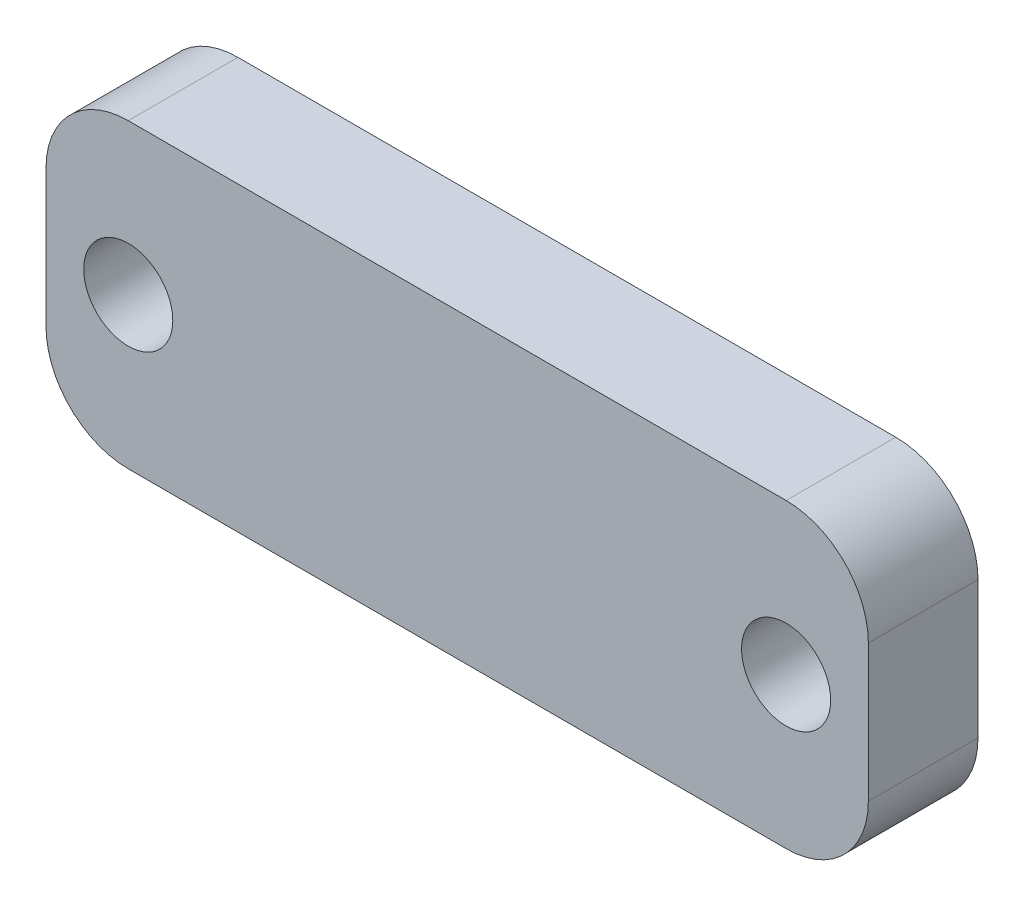
ISO-10303-21;
HEADER;
FILE_DESCRIPTION(('STEP AP214'),'2;1');
FILE_NAME('part.step','',(''),(''),'','','');
FILE_SCHEMA(('AUTOMOTIVE_DESIGN { 1 0 10303 214 1 1 1 1 }'));
ENDSEC;
DATA;
#1=APPLICATION_CONTEXT('core data for automotive mechanical design processes');
#2=APPLICATION_PROTOCOL_DEFINITION('international standard','automotive_design',2000,#1);
#3=PRODUCT_CONTEXT('',#1,'mechanical');
#4=PRODUCT('Part','Part','',(#3));
#5=PRODUCT_RELATED_PRODUCT_CATEGORY('part','',(#4));
#6=PRODUCT_DEFINITION_FORMATION('','',#4);
#7=PRODUCT_DEFINITION_CONTEXT('part definition',#1,'design');
#8=PRODUCT_DEFINITION('design','',#6,#7);
#9=PRODUCT_DEFINITION_SHAPE('','',#8);
#10=(LENGTH_UNIT() NAMED_UNIT(*) SI_UNIT(.MILLI.,.METRE.));
#11=(NAMED_UNIT(*) PLANE_ANGLE_UNIT() SI_UNIT($,.RADIAN.));
#12=(NAMED_UNIT(*) SI_UNIT($,.STERADIAN.) SOLID_ANGLE_UNIT());
#13=UNCERTAINTY_MEASURE_WITH_UNIT(LENGTH_MEASURE(1.E-05),#10,'distance_accuracy_value','');
#14=(GEOMETRIC_REPRESENTATION_CONTEXT(3) GLOBAL_UNCERTAINTY_ASSIGNED_CONTEXT((#13)) GLOBAL_UNIT_ASSIGNED_CONTEXT((#10,
#11,#12)) REPRESENTATION_CONTEXT('',''));
#15=CARTESIAN_POINT('',(0.,0.,0.));
#16=DIRECTION('',(0.,0.,1.));
#17=DIRECTION('',(1.,0.,0.));
#18=AXIS2_PLACEMENT_3D('',#15,#16,#17);
#19=CARTESIAN_POINT('',(-47.625,17.4625,12.7));
#20=DIRECTION('',(1.,0.,0.));
#21=DIRECTION('',(0.,1.,0.));
#22=AXIS2_PLACEMENT_3D('',#19,#20,#21);
#23=PLANE('',#22);
#24=DIRECTION('',(0.,-1.,0.));
#25=VECTOR('',#24,1.);
#26=CARTESIAN_POINT('',(-47.625,17.4625,0.));
#27=LINE('',#26,#25);
#28=CARTESIAN_POINT('',(-47.625,7.93749999999999,0.));
#29=VERTEX_POINT('',#28);
#30=CARTESIAN_POINT('',(-47.625,-7.93750000000001,0.));
#31=VERTEX_POINT('',#30);
#32=EDGE_CURVE('E131',#29,#31,#27,.T.);
#33=ORIENTED_EDGE('',*,*,#32,.T.);
#34=DIRECTION('',(0.,0.,-1.));
#35=VECTOR('',#34,1.);
#36=CARTESIAN_POINT('',(-47.625,-7.93750000000001,12.7));
#37=LINE('',#36,#35);
#38=CARTESIAN_POINT('',(-47.625,-7.93750000000001,12.7));
#39=VERTEX_POINT('',#38);
#40=EDGE_CURVE('E108',#31,#39,#37,.F.);
#41=ORIENTED_EDGE('',*,*,#40,.T.);
#42=DIRECTION('',(0.,-1.,0.));
#43=VECTOR('',#42,1.);
#44=CARTESIAN_POINT('',(-47.625,17.4625,12.7));
#45=LINE('',#44,#43);
#46=CARTESIAN_POINT('',(-47.625,7.93749999999999,12.7));
#47=VERTEX_POINT('',#46);
#48=EDGE_CURVE('E141',#47,#39,#45,.T.);
#49=ORIENTED_EDGE('',*,*,#48,.F.);
#50=DIRECTION('',(0.,0.,-1.));
#51=VECTOR('',#50,1.);
#52=CARTESIAN_POINT('',(-47.625,7.93749999999999,12.7));
#53=LINE('',#52,#51);
#54=EDGE_CURVE('E113',#47,#29,#53,.T.);
#55=ORIENTED_EDGE('',*,*,#54,.T.);
#56=EDGE_LOOP('',(#33,#41,#49,#55));
#57=FACE_BOUND('',#56,.T.);
#58=ADVANCED_FACE('F36',(#57),#23,.F.);
#59=CARTESIAN_POINT('',(47.625,-17.4625,12.7));
#60=DIRECTION('',(0.,1.,0.));
#61=DIRECTION('',(-1.,0.,0.));
#62=AXIS2_PLACEMENT_3D('',#59,#60,#61);
#63=PLANE('',#62);
#64=DIRECTION('',(1.,0.,0.));
#65=VECTOR('',#64,1.);
#66=CARTESIAN_POINT('',(47.625,-17.4625,12.7));
#67=LINE('',#66,#65);
#68=CARTESIAN_POINT('',(-38.1,-17.4625,12.7));
#69=VERTEX_POINT('',#68);
#70=CARTESIAN_POINT('',(38.1,-17.4625,12.7));
#71=VERTEX_POINT('',#70);
#72=EDGE_CURVE('E123',#69,#71,#67,.T.);
#73=ORIENTED_EDGE('',*,*,#72,.F.);
#74=DIRECTION('',(0.,0.,-1.));
#75=VECTOR('',#74,1.);
#76=CARTESIAN_POINT('',(-38.1,-17.4625,12.7));
#77=LINE('',#76,#75);
#78=CARTESIAN_POINT('',(-38.1,-17.4625,0.));
#79=VERTEX_POINT('',#78);
#80=EDGE_CURVE('E107',#69,#79,#77,.T.);
#81=ORIENTED_EDGE('',*,*,#80,.T.);
#82=DIRECTION('',(1.,0.,0.));
#83=VECTOR('',#82,1.);
#84=CARTESIAN_POINT('',(47.625,-17.4625,0.));
#85=LINE('',#84,#83);
#86=CARTESIAN_POINT('',(38.1,-17.4625,0.));
#87=VERTEX_POINT('',#86);
#88=EDGE_CURVE('E120',#79,#87,#85,.T.);
#89=ORIENTED_EDGE('',*,*,#88,.T.);
#90=DIRECTION('',(0.,0.,-1.));
#91=VECTOR('',#90,1.);
#92=CARTESIAN_POINT('',(38.1,-17.4625,12.7));
#93=LINE('',#92,#91);
#94=EDGE_CURVE('E125',#87,#71,#93,.F.);
#95=ORIENTED_EDGE('',*,*,#94,.T.);
#96=EDGE_LOOP('',(#73,#81,#89,#95));
#97=FACE_BOUND('',#96,.T.);
#98=ADVANCED_FACE('F119',(#97),#63,.F.);
#99=CARTESIAN_POINT('',(47.625,17.4625,12.7));
#100=DIRECTION('',(-1.,0.,0.));
#101=DIRECTION('',(0.,0.,1.));
#102=AXIS2_PLACEMENT_3D('',#99,#100,#101);
#103=PLANE('',#102);
#104=DIRECTION('',(0.,1.,0.));
#105=VECTOR('',#104,1.);
#106=CARTESIAN_POINT('',(47.625,17.4625,12.7));
#107=LINE('',#106,#105);
#108=CARTESIAN_POINT('',(47.625,-7.9375,12.7));
#109=VERTEX_POINT('',#108);
#110=CARTESIAN_POINT('',(47.625,7.9375,12.7));
#111=VERTEX_POINT('',#110);
#112=EDGE_CURVE('E170',#109,#111,#107,.T.);
#113=ORIENTED_EDGE('',*,*,#112,.F.);
#114=DIRECTION('',(0.,0.,-1.));
#115=VECTOR('',#114,1.);
#116=CARTESIAN_POINT('',(47.625,-7.9375,12.7));
#117=LINE('',#116,#115);
#118=CARTESIAN_POINT('',(47.625,-7.9375,0.));
#119=VERTEX_POINT('',#118);
#120=EDGE_CURVE('E11',#109,#119,#117,.T.);
#121=ORIENTED_EDGE('',*,*,#120,.T.);
#122=DIRECTION('',(0.,1.,0.));
#123=VECTOR('',#122,1.);
#124=CARTESIAN_POINT('',(47.625,17.4625,0.));
#125=LINE('',#124,#123);
#126=CARTESIAN_POINT('',(47.625,7.9375,0.));
#127=VERTEX_POINT('',#126);
#128=EDGE_CURVE('E130',#119,#127,#125,.T.);
#129=ORIENTED_EDGE('',*,*,#128,.T.);
#130=DIRECTION('',(0.,0.,-1.));
#131=VECTOR('',#130,1.);
#132=CARTESIAN_POINT('',(47.625,7.9375,12.7));
#133=LINE('',#132,#131);
#134=EDGE_CURVE('E44',#127,#111,#133,.F.);
#135=ORIENTED_EDGE('',*,*,#134,.T.);
#136=EDGE_LOOP('',(#113,#121,#129,#135));
#137=FACE_BOUND('',#136,.T.);
#138=ADVANCED_FACE('F169',(#137),#103,.F.);
#139=CARTESIAN_POINT('',(47.625,17.4625,12.7));
#140=DIRECTION('',(0.,-1.,0.));
#141=DIRECTION('',(1.,0.,0.));
#142=AXIS2_PLACEMENT_3D('',#139,#140,#141);
#143=PLANE('',#142);
#144=DIRECTION('',(-1.,0.,0.));
#145=VECTOR('',#144,1.);
#146=CARTESIAN_POINT('',(47.625,17.4625,0.));
#147=LINE('',#146,#145);
#148=CARTESIAN_POINT('',(38.1,17.4625,0.));
#149=VERTEX_POINT('',#148);
#150=CARTESIAN_POINT('',(-38.1,17.4625,0.));
#151=VERTEX_POINT('',#150);
#152=EDGE_CURVE('E134',#149,#151,#147,.T.);
#153=ORIENTED_EDGE('',*,*,#152,.T.);
#154=DIRECTION('',(0.,0.,-1.));
#155=VECTOR('',#154,1.);
#156=CARTESIAN_POINT('',(-38.1,17.4625,12.7));
#157=LINE('',#156,#155);
#158=CARTESIAN_POINT('',(-38.1,17.4625,12.7));
#159=VERTEX_POINT('',#158);
#160=EDGE_CURVE('E51',#151,#159,#157,.F.);
#161=ORIENTED_EDGE('',*,*,#160,.T.);
#162=DIRECTION('',(-1.,0.,0.));
#163=VECTOR('',#162,1.);
#164=CARTESIAN_POINT('',(47.625,17.4625,12.7));
#165=LINE('',#164,#163);
#166=CARTESIAN_POINT('',(38.1,17.4625,12.7));
#167=VERTEX_POINT('',#166);
#168=EDGE_CURVE('E146',#167,#159,#165,.T.);
#169=ORIENTED_EDGE('',*,*,#168,.F.);
#170=DIRECTION('',(0.,0.,-1.));
#171=VECTOR('',#170,1.);
#172=CARTESIAN_POINT('',(38.1,17.4625,12.7));
#173=LINE('',#172,#171);
#174=EDGE_CURVE('E163',#167,#149,#173,.T.);
#175=ORIENTED_EDGE('',*,*,#174,.T.);
#176=EDGE_LOOP('',(#153,#161,#169,#175));
#177=FACE_BOUND('',#176,.T.);
#178=ADVANCED_FACE('F179',(#177),#143,.F.);
#179=CARTESIAN_POINT('',(-47.625,-17.4625,12.7));
#180=DIRECTION('',(0.,0.,-1.));
#181=DIRECTION('',(-1.,0.,0.));
#182=AXIS2_PLACEMENT_3D('',#179,#180,#181);
#183=PLANE('',#182);
#184=CARTESIAN_POINT('',(38.1,0.,12.7));
#185=DIRECTION('',(0.,0.,1.));
#186=DIRECTION('',(1.,0.,0.));
#187=AXIS2_PLACEMENT_3D('',#184,#185,#186);
#188=CIRCLE('',#187,5.159375);
#189=CARTESIAN_POINT('',(43.259375,0.,12.7));
#190=VERTEX_POINT('',#189);
#191=EDGE_CURVE('E200',#190,#190,#188,.T.);
#192=ORIENTED_EDGE('',*,*,#191,.F.);
#193=EDGE_LOOP('',(#192));
#194=FACE_BOUND('',#193,.T.);
#195=CARTESIAN_POINT('',(-38.1,0.,12.7));
#196=DIRECTION('',(0.,0.,1.));
#197=DIRECTION('',(1.,0.,0.));
#198=AXIS2_PLACEMENT_3D('',#195,#196,#197);
#199=CIRCLE('',#198,5.159375);
#200=CARTESIAN_POINT('',(-32.940625,0.,12.7));
#201=VERTEX_POINT('',#200);
#202=EDGE_CURVE('E194',#201,#201,#199,.T.);
#203=ORIENTED_EDGE('',*,*,#202,.F.);
#204=EDGE_LOOP('',(#203));
#205=FACE_BOUND('',#204,.T.);
#206=ORIENTED_EDGE('',*,*,#48,.T.);
#207=CARTESIAN_POINT('',(-38.1,-7.93750000000001,12.7));
#208=DIRECTION('',(0.,0.,-1.));
#209=DIRECTION('',(-1.,0.,0.));
#210=AXIS2_PLACEMENT_3D('',#207,#208,#209);
#211=CIRCLE('',#210,9.525);
#212=EDGE_CURVE('E161',#39,#69,#211,.F.);
#213=ORIENTED_EDGE('',*,*,#212,.T.);
#214=ORIENTED_EDGE('',*,*,#72,.T.);
#215=CARTESIAN_POINT('',(38.1,-7.9375,12.7));
#216=DIRECTION('',(0.,0.,-1.));
#217=DIRECTION('',(-1.,0.,0.));
#218=AXIS2_PLACEMENT_3D('',#215,#216,#217);
#219=CIRCLE('',#218,9.525);
#220=EDGE_CURVE('E157',#71,#109,#219,.F.);
#221=ORIENTED_EDGE('',*,*,#220,.T.);
#222=ORIENTED_EDGE('',*,*,#112,.T.);
#223=CARTESIAN_POINT('',(38.1,7.9375,12.7));
#224=DIRECTION('',(0.,0.,-1.));
#225=DIRECTION('',(-1.,0.,0.));
#226=AXIS2_PLACEMENT_3D('',#223,#224,#225);
#227=CIRCLE('',#226,9.525);
#228=EDGE_CURVE('E58',#111,#167,#227,.F.);
#229=ORIENTED_EDGE('',*,*,#228,.T.);
#230=ORIENTED_EDGE('',*,*,#168,.T.);
#231=CARTESIAN_POINT('',(-38.1,7.9375,12.7));
#232=DIRECTION('',(0.,0.,-1.));
#233=DIRECTION('',(-1.,0.,0.));
#234=AXIS2_PLACEMENT_3D('',#231,#232,#233);
#235=CIRCLE('',#234,9.525);
#236=EDGE_CURVE('E159',#159,#47,#235,.F.);
#237=ORIENTED_EDGE('',*,*,#236,.T.);
#238=EDGE_LOOP('',(#206,#213,#214,#221,#222,#229,#230,#237));
#239=FACE_BOUND('',#238,.T.);
#240=ADVANCED_FACE('F174',(#194,#205,#239),#183,.F.);
#241=CARTESIAN_POINT('',(-47.625,-17.4625,0.));
#242=DIRECTION('',(0.,0.,-1.));
#243=DIRECTION('',(-1.,0.,0.));
#244=AXIS2_PLACEMENT_3D('',#241,#242,#243);
#245=PLANE('',#244);
#246=CARTESIAN_POINT('',(0.,0.,0.));
#247=DIRECTION('',(0.,0.,-1.));
#248=DIRECTION('',(-1.,0.,0.));
#249=AXIS2_PLACEMENT_3D('',#246,#247,#248);
#250=CIRCLE('',#249,14.4145);
#251=CARTESIAN_POINT('',(-14.4145,0.,0.));
#252=VERTEX_POINT('',#251);
#253=EDGE_CURVE('E142',#252,#252,#250,.F.);
#254=ORIENTED_EDGE('',*,*,#253,.T.);
#255=EDGE_LOOP('',(#254));
#256=FACE_BOUND('',#255,.T.);
#257=CARTESIAN_POINT('',(38.1,0.,0.));
#258=DIRECTION('',(0.,0.,-1.));
#259=DIRECTION('',(-1.,0.,0.));
#260=AXIS2_PLACEMENT_3D('',#257,#258,#259);
#261=CIRCLE('',#260,5.159375);
#262=CARTESIAN_POINT('',(32.940625,0.,0.));
#263=VERTEX_POINT('',#262);
#264=EDGE_CURVE('E197',#263,#263,#261,.T.);
#265=ORIENTED_EDGE('',*,*,#264,.F.);
#266=EDGE_LOOP('',(#265));
#267=FACE_BOUND('',#266,.T.);
#268=CARTESIAN_POINT('',(-38.1,0.,0.));
#269=DIRECTION('',(0.,0.,-1.));
#270=DIRECTION('',(-1.,0.,0.));
#271=AXIS2_PLACEMENT_3D('',#268,#269,#270);
#272=CIRCLE('',#271,5.159375);
#273=CARTESIAN_POINT('',(-43.259375,0.,0.));
#274=VERTEX_POINT('',#273);
#275=EDGE_CURVE('E191',#274,#274,#272,.T.);
#276=ORIENTED_EDGE('',*,*,#275,.F.);
#277=EDGE_LOOP('',(#276));
#278=FACE_BOUND('',#277,.T.);
#279=ORIENTED_EDGE('',*,*,#88,.F.);
#280=CARTESIAN_POINT('',(-38.1,-7.93750000000001,0.));
#281=DIRECTION('',(0.,0.,-1.));
#282=DIRECTION('',(-1.,0.,0.));
#283=AXIS2_PLACEMENT_3D('',#280,#281,#282);
#284=CIRCLE('',#283,9.525);
#285=EDGE_CURVE('E103',#79,#31,#284,.T.);
#286=ORIENTED_EDGE('',*,*,#285,.T.);
#287=ORIENTED_EDGE('',*,*,#32,.F.);
#288=CARTESIAN_POINT('',(-38.1,7.9375,0.));
#289=DIRECTION('',(0.,0.,-1.));
#290=DIRECTION('',(-1.,0.,0.));
#291=AXIS2_PLACEMENT_3D('',#288,#289,#290);
#292=CIRCLE('',#291,9.525);
#293=EDGE_CURVE('E114',#29,#151,#292,.T.);
#294=ORIENTED_EDGE('',*,*,#293,.T.);
#295=ORIENTED_EDGE('',*,*,#152,.F.);
#296=CARTESIAN_POINT('',(38.1,7.9375,0.));
#297=DIRECTION('',(0.,0.,-1.));
#298=DIRECTION('',(-1.,0.,0.));
#299=AXIS2_PLACEMENT_3D('',#296,#297,#298);
#300=CIRCLE('',#299,9.525);
#301=EDGE_CURVE('E124',#149,#127,#300,.T.);
#302=ORIENTED_EDGE('',*,*,#301,.T.);
#303=ORIENTED_EDGE('',*,*,#128,.F.);
#304=CARTESIAN_POINT('',(38.1,-7.9375,0.));
#305=DIRECTION('',(0.,0.,-1.));
#306=DIRECTION('',(-1.,0.,0.));
#307=AXIS2_PLACEMENT_3D('',#304,#305,#306);
#308=CIRCLE('',#307,9.525);
#309=EDGE_CURVE('E129',#119,#87,#308,.T.);
#310=ORIENTED_EDGE('',*,*,#309,.T.);
#311=EDGE_LOOP('',(#279,#286,#287,#294,#295,#302,#303,#310));
#312=FACE_BOUND('',#311,.T.);
#313=ADVANCED_FACE('F127',(#256,#267,#278,#312),#245,.T.);
#314=CARTESIAN_POINT('',(0.,0.,4.7625));
#315=DIRECTION('',(0.,0.,-1.));
#316=DIRECTION('',(-1.,0.,0.));
#317=AXIS2_PLACEMENT_3D('',#314,#315,#316);
#318=CYLINDRICAL_SURFACE('',#317,12.827);
#319=CARTESIAN_POINT('',(0.,0.,1.58749999999997));
#320=DIRECTION('',(0.,0.,-1.));
#321=DIRECTION('',(-1.,0.,0.));
#322=AXIS2_PLACEMENT_3D('',#319,#320,#321);
#323=CIRCLE('',#322,12.827);
#324=CARTESIAN_POINT('',(-12.827,0.,1.58749999999997));
#325=VERTEX_POINT('',#324);
#326=EDGE_CURVE('E145',#325,#325,#323,.T.);
#327=ORIENTED_EDGE('',*,*,#326,.T.);
#328=EDGE_LOOP('',(#327));
#329=FACE_BOUND('',#328,.T.);
#330=CARTESIAN_POINT('',(0.,0.,4.7625));
#331=DIRECTION('',(0.,0.,1.));
#332=DIRECTION('',(1.,0.,0.));
#333=AXIS2_PLACEMENT_3D('',#330,#331,#332);
#334=CIRCLE('',#333,12.827);
#335=CARTESIAN_POINT('',(12.827,0.,4.7625));
#336=VERTEX_POINT('',#335);
#337=EDGE_CURVE('E136',#336,#336,#334,.T.);
#338=ORIENTED_EDGE('',*,*,#337,.T.);
#339=EDGE_LOOP('',(#338));
#340=FACE_BOUND('',#339,.T.);
#341=ADVANCED_FACE('F220',(#329,#340),#318,.F.);
#342=CARTESIAN_POINT('',(0.,0.,4.7625));
#343=DIRECTION('',(0.,0.,1.));
#344=DIRECTION('',(1.,0.,0.));
#345=AXIS2_PLACEMENT_3D('',#342,#343,#344);
#346=PLANE('',#345);
#347=ORIENTED_EDGE('',*,*,#337,.F.);
#348=EDGE_LOOP('',(#347));
#349=FACE_BOUND('',#348,.T.);
#350=ADVANCED_FACE('F215',(#349),#346,.F.);
#351=CARTESIAN_POINT('',(-38.1,0.,12.7));
#352=DIRECTION('',(0.,0.,1.));
#353=DIRECTION('',(1.,0.,0.));
#354=AXIS2_PLACEMENT_3D('',#351,#352,#353);
#355=CYLINDRICAL_SURFACE('',#354,5.159375);
#356=ORIENTED_EDGE('',*,*,#202,.T.);
#357=EDGE_LOOP('',(#356));
#358=FACE_BOUND('',#357,.T.);
#359=ORIENTED_EDGE('',*,*,#275,.T.);
#360=EDGE_LOOP('',(#359));
#361=FACE_BOUND('',#360,.T.);
#362=ADVANCED_FACE('F212',(#358,#361),#355,.F.);
#363=CARTESIAN_POINT('',(38.1,0.,12.7));
#364=DIRECTION('',(0.,0.,1.));
#365=DIRECTION('',(1.,0.,0.));
#366=AXIS2_PLACEMENT_3D('',#363,#364,#365);
#367=CYLINDRICAL_SURFACE('',#366,5.159375);
#368=ORIENTED_EDGE('',*,*,#191,.T.);
#369=EDGE_LOOP('',(#368));
#370=FACE_BOUND('',#369,.T.);
#371=ORIENTED_EDGE('',*,*,#264,.T.);
#372=EDGE_LOOP('',(#371));
#373=FACE_BOUND('',#372,.T.);
#374=ADVANCED_FACE('F204',(#370,#373),#367,.F.);
#375=CARTESIAN_POINT('',(0.,0.,0.));
#376=DIRECTION('',(0.,0.,-1.));
#377=DIRECTION('',(-1.,0.,0.));
#378=AXIS2_PLACEMENT_3D('',#375,#376,#377);
#379=CONICAL_SURFACE('',#378,14.4145,0.78539816339745);
#380=ORIENTED_EDGE('',*,*,#326,.F.);
#381=EDGE_LOOP('',(#380));
#382=FACE_BOUND('',#381,.T.);
#383=ORIENTED_EDGE('',*,*,#253,.F.);
#384=EDGE_LOOP('',(#383));
#385=FACE_BOUND('',#384,.T.);
#386=ADVANCED_FACE('F238',(#382,#385),#379,.F.);
#387=CARTESIAN_POINT('',(-38.1,-7.93750000000001,12.7));
#388=DIRECTION('',(0.,0.,-1.));
#389=DIRECTION('',(-1.,0.,0.));
#390=AXIS2_PLACEMENT_3D('',#387,#388,#389);
#391=CYLINDRICAL_SURFACE('',#390,9.525);
#392=ORIENTED_EDGE('',*,*,#212,.F.);
#393=ORIENTED_EDGE('',*,*,#40,.F.);
#394=ORIENTED_EDGE('',*,*,#285,.F.);
#395=ORIENTED_EDGE('',*,*,#80,.F.);
#396=EDGE_LOOP('',(#392,#393,#394,#395));
#397=FACE_BOUND('',#396,.T.);
#398=ADVANCED_FACE('F106',(#397),#391,.T.);
#399=CARTESIAN_POINT('',(-38.1,7.9375,12.7));
#400=DIRECTION('',(0.,0.,-1.));
#401=DIRECTION('',(-1.,0.,0.));
#402=AXIS2_PLACEMENT_3D('',#399,#400,#401);
#403=CYLINDRICAL_SURFACE('',#402,9.525);
#404=ORIENTED_EDGE('',*,*,#236,.F.);
#405=ORIENTED_EDGE('',*,*,#160,.F.);
#406=ORIENTED_EDGE('',*,*,#293,.F.);
#407=ORIENTED_EDGE('',*,*,#54,.F.);
#408=EDGE_LOOP('',(#404,#405,#406,#407));
#409=FACE_BOUND('',#408,.T.);
#410=ADVANCED_FACE('F183',(#409),#403,.T.);
#411=CARTESIAN_POINT('',(38.1,-7.9375,12.7));
#412=DIRECTION('',(0.,0.,-1.));
#413=DIRECTION('',(-1.,0.,0.));
#414=AXIS2_PLACEMENT_3D('',#411,#412,#413);
#415=CYLINDRICAL_SURFACE('',#414,9.525);
#416=ORIENTED_EDGE('',*,*,#220,.F.);
#417=ORIENTED_EDGE('',*,*,#94,.F.);
#418=ORIENTED_EDGE('',*,*,#309,.F.);
#419=ORIENTED_EDGE('',*,*,#120,.F.);
#420=EDGE_LOOP('',(#416,#417,#418,#419));
#421=FACE_BOUND('',#420,.T.);
#422=ADVANCED_FACE('F245',(#421),#415,.T.);
#423=CARTESIAN_POINT('',(38.1,7.9375,12.7));
#424=DIRECTION('',(0.,0.,-1.));
#425=DIRECTION('',(-1.,0.,0.));
#426=AXIS2_PLACEMENT_3D('',#423,#424,#425);
#427=CYLINDRICAL_SURFACE('',#426,9.525);
#428=ORIENTED_EDGE('',*,*,#228,.F.);
#429=ORIENTED_EDGE('',*,*,#134,.F.);
#430=ORIENTED_EDGE('',*,*,#301,.F.);
#431=ORIENTED_EDGE('',*,*,#174,.F.);
#432=EDGE_LOOP('',(#428,#429,#430,#431));
#433=FACE_BOUND('',#432,.T.);
#434=ADVANCED_FACE('F38',(#433),#427,.T.);
#435=CLOSED_SHELL('',(#58,#98,#138,#178,#240,#313,#341,#350,#362,#374,#386,#398,#410,#422,#434));
#436=MANIFOLD_SOLID_BREP('B2',#435);
#437=ADVANCED_BREP_SHAPE_REPRESENTATION('',(#18,#436),#14);
#438=SHAPE_DEFINITION_REPRESENTATION(#9,#437);
ENDSEC;
END-ISO-10303-21;
